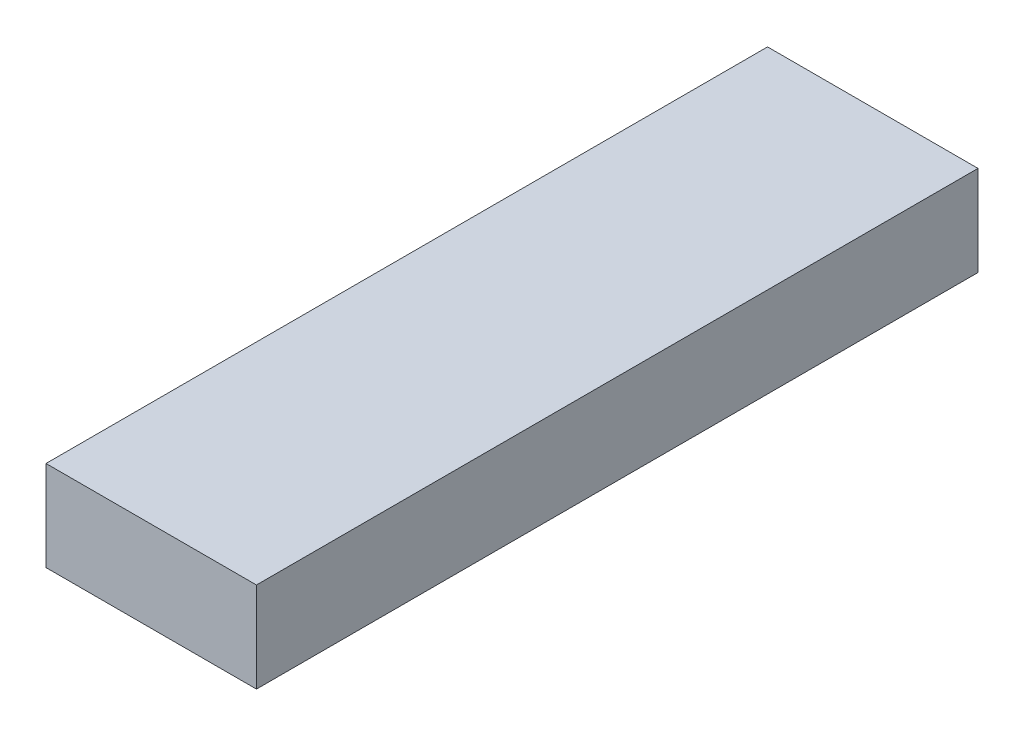
ISO-10303-21;
HEADER;
FILE_DESCRIPTION(('STEP AP214'),'2;1');
FILE_NAME('part.step','',(''),(''),'','','');
FILE_SCHEMA(('AUTOMOTIVE_DESIGN { 1 0 10303 214 1 1 1 1 }'));
ENDSEC;
DATA;
#1=APPLICATION_CONTEXT('core data for automotive mechanical design processes');
#2=APPLICATION_PROTOCOL_DEFINITION('international standard','automotive_design',2000,#1);
#3=PRODUCT_CONTEXT('',#1,'mechanical');
#4=PRODUCT('Part','Part','',(#3));
#5=PRODUCT_RELATED_PRODUCT_CATEGORY('part','',(#4));
#6=PRODUCT_DEFINITION_FORMATION('','',#4);
#7=PRODUCT_DEFINITION_CONTEXT('part definition',#1,'design');
#8=PRODUCT_DEFINITION('design','',#6,#7);
#9=PRODUCT_DEFINITION_SHAPE('','',#8);
#10=(LENGTH_UNIT() NAMED_UNIT(*) SI_UNIT(.MILLI.,.METRE.));
#11=(NAMED_UNIT(*) PLANE_ANGLE_UNIT() SI_UNIT($,.RADIAN.));
#12=(NAMED_UNIT(*) SI_UNIT($,.STERADIAN.) SOLID_ANGLE_UNIT());
#13=UNCERTAINTY_MEASURE_WITH_UNIT(LENGTH_MEASURE(1.E-05),#10,'distance_accuracy_value','');
#14=(GEOMETRIC_REPRESENTATION_CONTEXT(3) GLOBAL_UNCERTAINTY_ASSIGNED_CONTEXT((#13)) GLOBAL_UNIT_ASSIGNED_CONTEXT((#10,
#11,#12)) REPRESENTATION_CONTEXT('',''));
#15=CARTESIAN_POINT('',(0.,0.,0.));
#16=DIRECTION('',(0.,0.,1.));
#17=DIRECTION('',(1.,0.,0.));
#18=AXIS2_PLACEMENT_3D('',#15,#16,#17);
#19=CARTESIAN_POINT('',(0.,0.,304.8));
#20=DIRECTION('',(1.,0.,0.));
#21=DIRECTION('',(0.,0.,-1.));
#22=AXIS2_PLACEMENT_3D('',#19,#20,#21);
#23=PLANE('',#22);
#24=DIRECTION('',(0.,-1.,0.));
#25=VECTOR('',#24,1.);
#26=CARTESIAN_POINT('',(0.,0.,0.));
#27=LINE('',#26,#25);
#28=CARTESIAN_POINT('',(0.,38.1,0.));
#29=VERTEX_POINT('',#28);
#30=CARTESIAN_POINT('',(0.,0.,0.));
#31=VERTEX_POINT('',#30);
#32=EDGE_CURVE('E97',#29,#31,#27,.T.);
#33=ORIENTED_EDGE('',*,*,#32,.T.);
#34=DIRECTION('',(0.,0.,-1.));
#35=VECTOR('',#34,1.);
#36=CARTESIAN_POINT('',(0.,0.,304.8));
#37=LINE('',#36,#35);
#38=CARTESIAN_POINT('',(0.,0.,304.8));
#39=VERTEX_POINT('',#38);
#40=EDGE_CURVE('E11',#39,#31,#37,.T.);
#41=ORIENTED_EDGE('',*,*,#40,.F.);
#42=DIRECTION('',(0.,-1.,0.));
#43=VECTOR('',#42,1.);
#44=CARTESIAN_POINT('',(0.,0.,304.8));
#45=LINE('',#44,#43);
#46=CARTESIAN_POINT('',(0.,38.1,304.8));
#47=VERTEX_POINT('',#46);
#48=EDGE_CURVE('E85',#47,#39,#45,.T.);
#49=ORIENTED_EDGE('',*,*,#48,.F.);
#50=DIRECTION('',(0.,0.,-1.));
#51=VECTOR('',#50,1.);
#52=CARTESIAN_POINT('',(0.,38.1,304.8));
#53=LINE('',#52,#51);
#54=EDGE_CURVE('E93',#47,#29,#53,.T.);
#55=ORIENTED_EDGE('',*,*,#54,.T.);
#56=EDGE_LOOP('',(#33,#41,#49,#55));
#57=FACE_BOUND('',#56,.T.);
#58=ADVANCED_FACE('F34',(#57),#23,.F.);
#59=CARTESIAN_POINT('',(0.,0.,304.8));
#60=DIRECTION('',(0.,1.,0.));
#61=DIRECTION('',(0.,0.,1.));
#62=AXIS2_PLACEMENT_3D('',#59,#60,#61);
#63=PLANE('',#62);
#64=DIRECTION('',(1.,0.,0.));
#65=VECTOR('',#64,1.);
#66=CARTESIAN_POINT('',(0.,0.,0.));
#67=LINE('',#66,#65);
#68=CARTESIAN_POINT('',(88.9,0.,0.));
#69=VERTEX_POINT('',#68);
#70=EDGE_CURVE('E89',#31,#69,#67,.T.);
#71=ORIENTED_EDGE('',*,*,#70,.T.);
#72=DIRECTION('',(0.,0.,-1.));
#73=VECTOR('',#72,1.);
#74=CARTESIAN_POINT('',(88.9,0.,304.8));
#75=LINE('',#74,#73);
#76=CARTESIAN_POINT('',(88.9,0.,304.8));
#77=VERTEX_POINT('',#76);
#78=EDGE_CURVE('E42',#77,#69,#75,.T.);
#79=ORIENTED_EDGE('',*,*,#78,.F.);
#80=DIRECTION('',(1.,0.,0.));
#81=VECTOR('',#80,1.);
#82=CARTESIAN_POINT('',(0.,0.,304.8));
#83=LINE('',#82,#81);
#84=EDGE_CURVE('E80',#39,#77,#83,.T.);
#85=ORIENTED_EDGE('',*,*,#84,.F.);
#86=ORIENTED_EDGE('',*,*,#40,.T.);
#87=EDGE_LOOP('',(#71,#79,#85,#86));
#88=FACE_BOUND('',#87,.T.);
#89=ADVANCED_FACE('F88',(#88),#63,.F.);
#90=CARTESIAN_POINT('',(88.9,0.,304.8));
#91=DIRECTION('',(-1.,0.,0.));
#92=DIRECTION('',(0.,0.,1.));
#93=AXIS2_PLACEMENT_3D('',#90,#91,#92);
#94=PLANE('',#93);
#95=DIRECTION('',(0.,1.,0.));
#96=VECTOR('',#95,1.);
#97=CARTESIAN_POINT('',(88.9,0.,0.));
#98=LINE('',#97,#96);
#99=CARTESIAN_POINT('',(88.9,38.1,0.));
#100=VERTEX_POINT('',#99);
#101=EDGE_CURVE('E67',#69,#100,#98,.T.);
#102=ORIENTED_EDGE('',*,*,#101,.T.);
#103=DIRECTION('',(0.,0.,-1.));
#104=VECTOR('',#103,1.);
#105=CARTESIAN_POINT('',(88.9,38.1,304.8));
#106=LINE('',#105,#104);
#107=CARTESIAN_POINT('',(88.9,38.1,304.8));
#108=VERTEX_POINT('',#107);
#109=EDGE_CURVE('E90',#108,#100,#106,.T.);
#110=ORIENTED_EDGE('',*,*,#109,.F.);
#111=DIRECTION('',(0.,1.,0.));
#112=VECTOR('',#111,1.);
#113=CARTESIAN_POINT('',(88.9,0.,304.8));
#114=LINE('',#113,#112);
#115=EDGE_CURVE('E83',#77,#108,#114,.T.);
#116=ORIENTED_EDGE('',*,*,#115,.F.);
#117=ORIENTED_EDGE('',*,*,#78,.T.);
#118=EDGE_LOOP('',(#102,#110,#116,#117));
#119=FACE_BOUND('',#118,.T.);
#120=ADVANCED_FACE('F91',(#119),#94,.F.);
#121=CARTESIAN_POINT('',(0.,38.1,304.8));
#122=DIRECTION('',(0.,-1.,0.));
#123=DIRECTION('',(0.,0.,-1.));
#124=AXIS2_PLACEMENT_3D('',#121,#122,#123);
#125=PLANE('',#124);
#126=DIRECTION('',(-1.,0.,0.));
#127=VECTOR('',#126,1.);
#128=CARTESIAN_POINT('',(0.,38.1,0.));
#129=LINE('',#128,#127);
#130=EDGE_CURVE('E73',#100,#29,#129,.T.);
#131=ORIENTED_EDGE('',*,*,#130,.T.);
#132=ORIENTED_EDGE('',*,*,#54,.F.);
#133=DIRECTION('',(-1.,0.,0.));
#134=VECTOR('',#133,1.);
#135=CARTESIAN_POINT('',(0.,38.1,304.8));
#136=LINE('',#135,#134);
#137=EDGE_CURVE('E50',#108,#47,#136,.T.);
#138=ORIENTED_EDGE('',*,*,#137,.F.);
#139=ORIENTED_EDGE('',*,*,#109,.T.);
#140=EDGE_LOOP('',(#131,#132,#138,#139));
#141=FACE_BOUND('',#140,.T.);
#142=ADVANCED_FACE('F104',(#141),#125,.F.);
#143=CARTESIAN_POINT('',(0.,0.,304.8));
#144=DIRECTION('',(0.,0.,-1.));
#145=DIRECTION('',(-1.,0.,0.));
#146=AXIS2_PLACEMENT_3D('',#143,#144,#145);
#147=PLANE('',#146);
#148=ORIENTED_EDGE('',*,*,#48,.T.);
#149=ORIENTED_EDGE('',*,*,#84,.T.);
#150=ORIENTED_EDGE('',*,*,#115,.T.);
#151=ORIENTED_EDGE('',*,*,#137,.T.);
#152=EDGE_LOOP('',(#148,#149,#150,#151));
#153=FACE_BOUND('',#152,.T.);
#154=ADVANCED_FACE('F81',(#153),#147,.F.);
#155=CARTESIAN_POINT('',(0.,0.,0.));
#156=DIRECTION('',(0.,0.,-1.));
#157=DIRECTION('',(-1.,0.,0.));
#158=AXIS2_PLACEMENT_3D('',#155,#156,#157);
#159=PLANE('',#158);
#160=ORIENTED_EDGE('',*,*,#32,.F.);
#161=ORIENTED_EDGE('',*,*,#130,.F.);
#162=ORIENTED_EDGE('',*,*,#101,.F.);
#163=ORIENTED_EDGE('',*,*,#70,.F.);
#164=EDGE_LOOP('',(#160,#161,#162,#163));
#165=FACE_BOUND('',#164,.T.);
#166=ADVANCED_FACE('F107',(#165),#159,.T.);
#167=CLOSED_SHELL('',(#58,#89,#120,#142,#154,#166));
#168=MANIFOLD_SOLID_BREP('B2',#167);
#169=ADVANCED_BREP_SHAPE_REPRESENTATION('',(#18,#168),#14);
#170=SHAPE_DEFINITION_REPRESENTATION(#9,#169);
ENDSEC;
END-ISO-10303-21;
